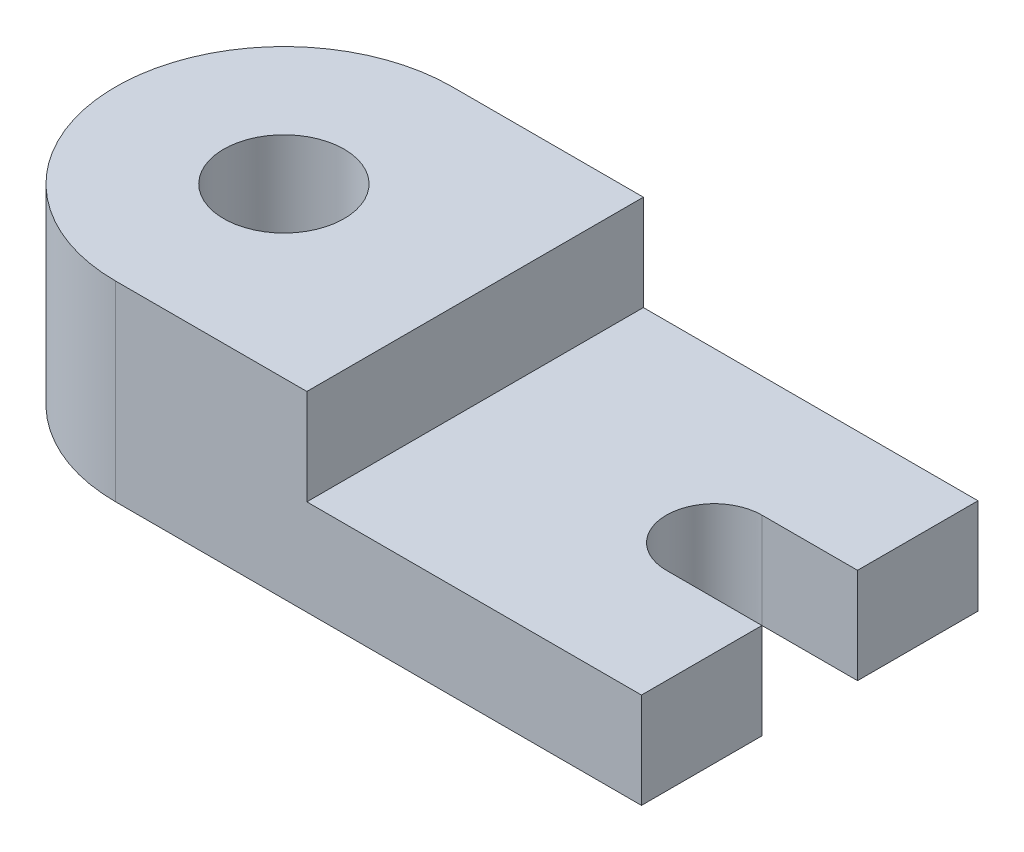
ISO-10303-21;
HEADER;
FILE_DESCRIPTION(('STEP AP214'),'2;1');
FILE_NAME('part.step','',(''),(''),'','','');
FILE_SCHEMA(('AUTOMOTIVE_DESIGN { 1 0 10303 214 1 1 1 1 }'));
ENDSEC;
DATA;
#1=APPLICATION_CONTEXT('core data for automotive mechanical design processes');
#2=APPLICATION_PROTOCOL_DEFINITION('international standard','automotive_design',2000,#1);
#3=PRODUCT_CONTEXT('',#1,'mechanical');
#4=PRODUCT('Part','Part','',(#3));
#5=PRODUCT_RELATED_PRODUCT_CATEGORY('part','',(#4));
#6=PRODUCT_DEFINITION_FORMATION('','',#4);
#7=PRODUCT_DEFINITION_CONTEXT('part definition',#1,'design');
#8=PRODUCT_DEFINITION('design','',#6,#7);
#9=PRODUCT_DEFINITION_SHAPE('','',#8);
#10=(LENGTH_UNIT() NAMED_UNIT(*) SI_UNIT(.MILLI.,.METRE.));
#11=(NAMED_UNIT(*) PLANE_ANGLE_UNIT() SI_UNIT($,.RADIAN.));
#12=(NAMED_UNIT(*) SI_UNIT($,.STERADIAN.) SOLID_ANGLE_UNIT());
#13=UNCERTAINTY_MEASURE_WITH_UNIT(LENGTH_MEASURE(1.E-05),#10,'distance_accuracy_value','');
#14=(GEOMETRIC_REPRESENTATION_CONTEXT(3) GLOBAL_UNCERTAINTY_ASSIGNED_CONTEXT((#13)) GLOBAL_UNIT_ASSIGNED_CONTEXT((#10,
#11,#12)) REPRESENTATION_CONTEXT('',''));
#15=CARTESIAN_POINT('',(0.,0.,0.));
#16=DIRECTION('',(0.,0.,1.));
#17=DIRECTION('',(1.,0.,0.));
#18=AXIS2_PLACEMENT_3D('',#15,#16,#17);
#19=CARTESIAN_POINT('',(0.,31.75,-22.352));
#20=DIRECTION('',(0.,0.,-1.));
#21=DIRECTION('',(-1.,0.,0.));
#22=AXIS2_PLACEMENT_3D('',#19,#20,#21);
#23=PLANE('',#22);
#24=DIRECTION('',(-1.,0.,0.));
#25=VECTOR('',#24,1.);
#26=CARTESIAN_POINT('',(25.4,25.4,-22.352));
#27=LINE('',#26,#25);
#28=CARTESIAN_POINT('',(25.4,25.4,-22.352));
#29=VERTEX_POINT('',#28);
#30=CARTESIAN_POINT('',(0.,25.4,-22.352));
#31=VERTEX_POINT('',#30);
#32=EDGE_CURVE('E120',#29,#31,#27,.T.);
#33=ORIENTED_EDGE('',*,*,#32,.F.);
#34=DIRECTION('',(0.,-1.,0.));
#35=VECTOR('',#34,1.);
#36=CARTESIAN_POINT('',(25.4,31.75,-22.352));
#37=LINE('',#36,#35);
#38=CARTESIAN_POINT('',(25.4,12.7,-22.352));
#39=VERTEX_POINT('',#38);
#40=EDGE_CURVE('E65',#29,#39,#37,.T.);
#41=ORIENTED_EDGE('',*,*,#40,.T.);
#42=DIRECTION('',(1.,0.,0.));
#43=VECTOR('',#42,1.);
#44=CARTESIAN_POINT('',(0.,12.7,-22.352));
#45=LINE('',#44,#43);
#46=CARTESIAN_POINT('',(69.85,12.7,-22.352));
#47=VERTEX_POINT('',#46);
#48=EDGE_CURVE('E221',#39,#47,#45,.T.);
#49=ORIENTED_EDGE('',*,*,#48,.T.);
#50=DIRECTION('',(0.,-1.,0.));
#51=VECTOR('',#50,1.);
#52=CARTESIAN_POINT('',(69.85,12.7,-22.352));
#53=LINE('',#52,#51);
#54=CARTESIAN_POINT('',(69.85,0.,-22.352));
#55=VERTEX_POINT('',#54);
#56=EDGE_CURVE('E176',#47,#55,#53,.T.);
#57=ORIENTED_EDGE('',*,*,#56,.T.);
#58=DIRECTION('',(1.,0.,0.));
#59=VECTOR('',#58,1.);
#60=CARTESIAN_POINT('',(0.,0.,-22.352));
#61=LINE('',#60,#59);
#62=CARTESIAN_POINT('',(0.,0.,-22.352));
#63=VERTEX_POINT('',#62);
#64=EDGE_CURVE('E162',#63,#55,#61,.T.);
#65=ORIENTED_EDGE('',*,*,#64,.F.);
#66=DIRECTION('',(0.,-1.,0.));
#67=VECTOR('',#66,1.);
#68=CARTESIAN_POINT('',(0.,31.75,-22.352));
#69=LINE('',#68,#67);
#70=EDGE_CURVE('E11',#31,#63,#69,.T.);
#71=ORIENTED_EDGE('',*,*,#70,.F.);
#72=EDGE_LOOP('',(#33,#41,#49,#57,#65,#71));
#73=FACE_BOUND('',#72,.T.);
#74=ADVANCED_FACE('F41',(#73),#23,.T.);
#75=CARTESIAN_POINT('',(0.,31.75,0.));
#76=DIRECTION('',(0.,-1.,0.));
#77=DIRECTION('',(0.,0.,-1.));
#78=AXIS2_PLACEMENT_3D('',#75,#76,#77);
#79=CYLINDRICAL_SURFACE('',#78,22.352);
#80=DIRECTION('',(0.,-1.,0.));
#81=VECTOR('',#80,1.);
#82=CARTESIAN_POINT('',(0.,31.75,22.352));
#83=LINE('',#82,#81);
#84=CARTESIAN_POINT('',(0.,25.4,22.352));
#85=VERTEX_POINT('',#84);
#86=CARTESIAN_POINT('',(0.,0.,22.352));
#87=VERTEX_POINT('',#86);
#88=EDGE_CURVE('E50',#85,#87,#83,.T.);
#89=ORIENTED_EDGE('',*,*,#88,.F.);
#90=CARTESIAN_POINT('',(0.,25.4,0.));
#91=DIRECTION('',(0.,-1.,0.));
#92=DIRECTION('',(0.,0.,-1.));
#93=AXIS2_PLACEMENT_3D('',#90,#91,#92);
#94=CIRCLE('',#93,22.352);
#95=EDGE_CURVE('E209',#85,#31,#94,.T.);
#96=ORIENTED_EDGE('',*,*,#95,.T.);
#97=ORIENTED_EDGE('',*,*,#70,.T.);
#98=CARTESIAN_POINT('',(0.,0.,0.));
#99=DIRECTION('',(0.,1.,0.));
#100=DIRECTION('',(0.,0.,1.));
#101=AXIS2_PLACEMENT_3D('',#98,#99,#100);
#102=CIRCLE('',#101,22.352);
#103=EDGE_CURVE('E141',#63,#87,#102,.T.);
#104=ORIENTED_EDGE('',*,*,#103,.T.);
#105=EDGE_LOOP('',(#89,#96,#97,#104));
#106=FACE_BOUND('',#105,.T.);
#107=ADVANCED_FACE('F160',(#106),#79,.T.);
#108=CARTESIAN_POINT('',(0.,31.75,22.352));
#109=DIRECTION('',(0.,0.,-1.));
#110=DIRECTION('',(-1.,0.,0.));
#111=AXIS2_PLACEMENT_3D('',#108,#109,#110);
#112=PLANE('',#111);
#113=DIRECTION('',(0.,-1.,0.));
#114=VECTOR('',#113,1.);
#115=CARTESIAN_POINT('',(25.4,31.75,22.352));
#116=LINE('',#115,#114);
#117=CARTESIAN_POINT('',(25.4,25.4,22.352));
#118=VERTEX_POINT('',#117);
#119=CARTESIAN_POINT('',(25.4,12.7,22.352));
#120=VERTEX_POINT('',#119);
#121=EDGE_CURVE('E135',#118,#120,#116,.T.);
#122=ORIENTED_EDGE('',*,*,#121,.F.);
#123=DIRECTION('',(-1.,0.,0.));
#124=VECTOR('',#123,1.);
#125=CARTESIAN_POINT('',(25.4,25.4,22.352));
#126=LINE('',#125,#124);
#127=EDGE_CURVE('E57',#118,#85,#126,.T.);
#128=ORIENTED_EDGE('',*,*,#127,.T.);
#129=ORIENTED_EDGE('',*,*,#88,.T.);
#130=DIRECTION('',(1.,0.,0.));
#131=VECTOR('',#130,1.);
#132=CARTESIAN_POINT('',(0.,0.,22.352));
#133=LINE('',#132,#131);
#134=CARTESIAN_POINT('',(69.85,0.,22.352));
#135=VERTEX_POINT('',#134);
#136=EDGE_CURVE('E136',#87,#135,#133,.T.);
#137=ORIENTED_EDGE('',*,*,#136,.T.);
#138=DIRECTION('',(0.,-1.,0.));
#139=VECTOR('',#138,1.);
#140=CARTESIAN_POINT('',(69.85,12.7,22.352));
#141=LINE('',#140,#139);
#142=CARTESIAN_POINT('',(69.85,12.7,22.352));
#143=VERTEX_POINT('',#142);
#144=EDGE_CURVE('E180',#143,#135,#141,.T.);
#145=ORIENTED_EDGE('',*,*,#144,.F.);
#146=DIRECTION('',(1.,0.,0.));
#147=VECTOR('',#146,1.);
#148=CARTESIAN_POINT('',(0.,12.7,22.352));
#149=LINE('',#148,#147);
#150=EDGE_CURVE('E216',#120,#143,#149,.T.);
#151=ORIENTED_EDGE('',*,*,#150,.F.);
#152=EDGE_LOOP('',(#122,#128,#129,#137,#145,#151));
#153=FACE_BOUND('',#152,.T.);
#154=ADVANCED_FACE('F148',(#153),#112,.F.);
#155=CARTESIAN_POINT('',(0.,31.75,0.));
#156=DIRECTION('',(0.,-1.,0.));
#157=DIRECTION('',(0.,0.,-1.));
#158=AXIS2_PLACEMENT_3D('',#155,#156,#157);
#159=CYLINDRICAL_SURFACE('',#158,8.001);
#160=CARTESIAN_POINT('',(0.,25.4,0.));
#161=DIRECTION('',(0.,-1.,0.));
#162=DIRECTION('',(0.,0.,-1.));
#163=AXIS2_PLACEMENT_3D('',#160,#161,#162);
#164=CIRCLE('',#163,8.001);
#165=CARTESIAN_POINT('',(0.,25.4,-8.001));
#166=VERTEX_POINT('',#165);
#167=EDGE_CURVE('E128',#166,#166,#164,.T.);
#168=ORIENTED_EDGE('',*,*,#167,.F.);
#169=EDGE_LOOP('',(#168));
#170=FACE_BOUND('',#169,.T.);
#171=CARTESIAN_POINT('',(0.,0.,0.));
#172=DIRECTION('',(0.,1.,0.));
#173=DIRECTION('',(0.,0.,1.));
#174=AXIS2_PLACEMENT_3D('',#171,#172,#173);
#175=CIRCLE('',#174,8.001);
#176=CARTESIAN_POINT('',(0.,0.,8.001));
#177=VERTEX_POINT('',#176);
#178=EDGE_CURVE('E164',#177,#177,#175,.T.);
#179=ORIENTED_EDGE('',*,*,#178,.F.);
#180=EDGE_LOOP('',(#179));
#181=FACE_BOUND('',#180,.T.);
#182=ADVANCED_FACE('F43',(#170,#181),#159,.F.);
#183=CARTESIAN_POINT('',(25.4,31.75,0.));
#184=DIRECTION('',(1.,0.,0.));
#185=DIRECTION('',(0.,0.,-1.));
#186=AXIS2_PLACEMENT_3D('',#183,#184,#185);
#187=PLANE('',#186);
#188=DIRECTION('',(0.,0.,1.));
#189=VECTOR('',#188,1.);
#190=CARTESIAN_POINT('',(25.4,25.4,-22.352));
#191=LINE('',#190,#189);
#192=EDGE_CURVE('E118',#29,#118,#191,.T.);
#193=ORIENTED_EDGE('',*,*,#192,.T.);
#194=ORIENTED_EDGE('',*,*,#121,.T.);
#195=DIRECTION('',(0.,0.,1.));
#196=VECTOR('',#195,1.);
#197=CARTESIAN_POINT('',(25.4,12.7,0.));
#198=LINE('',#197,#196);
#199=EDGE_CURVE('E132',#39,#120,#198,.T.);
#200=ORIENTED_EDGE('',*,*,#199,.F.);
#201=ORIENTED_EDGE('',*,*,#40,.F.);
#202=EDGE_LOOP('',(#193,#194,#200,#201));
#203=FACE_BOUND('',#202,.T.);
#204=ADVANCED_FACE('F130',(#203),#187,.T.);
#205=CARTESIAN_POINT('',(0.,0.,0.));
#206=DIRECTION('',(0.,1.,0.));
#207=DIRECTION('',(0.,0.,1.));
#208=AXIS2_PLACEMENT_3D('',#205,#206,#207);
#209=PLANE('',#208);
#210=ORIENTED_EDGE('',*,*,#178,.T.);
#211=EDGE_LOOP('',(#210));
#212=FACE_BOUND('',#211,.T.);
#213=ORIENTED_EDGE('',*,*,#64,.T.);
#214=DIRECTION('',(0.,0.,1.));
#215=VECTOR('',#214,1.);
#216=CARTESIAN_POINT('',(69.85,0.,0.));
#217=LINE('',#216,#215);
#218=CARTESIAN_POINT('',(69.85,0.,-6.35000000000001));
#219=VERTEX_POINT('',#218);
#220=EDGE_CURVE('E197',#55,#219,#217,.T.);
#221=ORIENTED_EDGE('',*,*,#220,.T.);
#222=DIRECTION('',(-1.,0.,0.));
#223=VECTOR('',#222,1.);
#224=CARTESIAN_POINT('',(0.,0.,-6.35));
#225=LINE('',#224,#223);
#226=CARTESIAN_POINT('',(57.15,0.,-6.35000000000001));
#227=VERTEX_POINT('',#226);
#228=EDGE_CURVE('E201',#219,#227,#225,.T.);
#229=ORIENTED_EDGE('',*,*,#228,.T.);
#230=CARTESIAN_POINT('',(57.15,0.,0.));
#231=DIRECTION('',(0.,1.,0.));
#232=DIRECTION('',(0.,0.,1.));
#233=AXIS2_PLACEMENT_3D('',#230,#231,#232);
#234=CIRCLE('',#233,6.35);
#235=CARTESIAN_POINT('',(57.15,0.,6.34999999999999));
#236=VERTEX_POINT('',#235);
#237=EDGE_CURVE('E205',#227,#236,#234,.T.);
#238=ORIENTED_EDGE('',*,*,#237,.T.);
#239=DIRECTION('',(-1.,0.,0.));
#240=VECTOR('',#239,1.);
#241=CARTESIAN_POINT('',(0.,0.,6.35));
#242=LINE('',#241,#240);
#243=CARTESIAN_POINT('',(69.85,0.,6.34999999999999));
#244=VERTEX_POINT('',#243);
#245=EDGE_CURVE('E190',#244,#236,#242,.T.);
#246=ORIENTED_EDGE('',*,*,#245,.F.);
#247=DIRECTION('',(0.,0.,1.));
#248=VECTOR('',#247,1.);
#249=CARTESIAN_POINT('',(69.85,0.,0.));
#250=LINE('',#249,#248);
#251=EDGE_CURVE('E159',#244,#135,#250,.T.);
#252=ORIENTED_EDGE('',*,*,#251,.T.);
#253=ORIENTED_EDGE('',*,*,#136,.F.);
#254=ORIENTED_EDGE('',*,*,#103,.F.);
#255=EDGE_LOOP('',(#213,#221,#229,#238,#246,#252,#253,#254));
#256=FACE_BOUND('',#255,.T.);
#257=ADVANCED_FACE('F156',(#212,#256),#209,.F.);
#258=CARTESIAN_POINT('',(57.15,12.7,0.));
#259=DIRECTION('',(0.,-1.,0.));
#260=DIRECTION('',(0.,0.,-1.));
#261=AXIS2_PLACEMENT_3D('',#258,#259,#260);
#262=CYLINDRICAL_SURFACE('',#261,6.35);
#263=ORIENTED_EDGE('',*,*,#237,.F.);
#264=DIRECTION('',(0.,-1.,0.));
#265=VECTOR('',#264,1.);
#266=CARTESIAN_POINT('',(57.15,12.7,-6.35000000000001));
#267=LINE('',#266,#265);
#268=CARTESIAN_POINT('',(57.15,12.7,-6.35000000000001));
#269=VERTEX_POINT('',#268);
#270=EDGE_CURVE('E170',#269,#227,#267,.T.);
#271=ORIENTED_EDGE('',*,*,#270,.F.);
#272=CARTESIAN_POINT('',(57.15,12.7,0.));
#273=DIRECTION('',(0.,1.,0.));
#274=DIRECTION('',(0.,0.,1.));
#275=AXIS2_PLACEMENT_3D('',#272,#273,#274);
#276=CIRCLE('',#275,6.35);
#277=CARTESIAN_POINT('',(57.15,12.7,6.34999999999999));
#278=VERTEX_POINT('',#277);
#279=EDGE_CURVE('E194',#269,#278,#276,.T.);
#280=ORIENTED_EDGE('',*,*,#279,.T.);
#281=DIRECTION('',(0.,-1.,0.));
#282=VECTOR('',#281,1.);
#283=CARTESIAN_POINT('',(57.15,12.7,6.34999999999999));
#284=LINE('',#283,#282);
#285=EDGE_CURVE('E186',#278,#236,#284,.T.);
#286=ORIENTED_EDGE('',*,*,#285,.T.);
#287=EDGE_LOOP('',(#263,#271,#280,#286));
#288=FACE_BOUND('',#287,.T.);
#289=ADVANCED_FACE('F249',(#288),#262,.F.);
#290=CARTESIAN_POINT('',(0.,12.7,-6.35));
#291=DIRECTION('',(0.,0.,1.));
#292=DIRECTION('',(1.,0.,0.));
#293=AXIS2_PLACEMENT_3D('',#290,#291,#292);
#294=PLANE('',#293);
#295=ORIENTED_EDGE('',*,*,#228,.F.);
#296=DIRECTION('',(0.,-1.,0.));
#297=VECTOR('',#296,1.);
#298=CARTESIAN_POINT('',(69.85,12.7,-6.35000000000001));
#299=LINE('',#298,#297);
#300=CARTESIAN_POINT('',(69.85,12.7,-6.35000000000001));
#301=VERTEX_POINT('',#300);
#302=EDGE_CURVE('E173',#301,#219,#299,.T.);
#303=ORIENTED_EDGE('',*,*,#302,.F.);
#304=DIRECTION('',(-1.,0.,0.));
#305=VECTOR('',#304,1.);
#306=CARTESIAN_POINT('',(0.,12.7,-6.35));
#307=LINE('',#306,#305);
#308=EDGE_CURVE('E228',#301,#269,#307,.T.);
#309=ORIENTED_EDGE('',*,*,#308,.T.);
#310=ORIENTED_EDGE('',*,*,#270,.T.);
#311=EDGE_LOOP('',(#295,#303,#309,#310));
#312=FACE_BOUND('',#311,.T.);
#313=ADVANCED_FACE('F255',(#312),#294,.T.);
#314=CARTESIAN_POINT('',(69.85,12.7,0.));
#315=DIRECTION('',(1.,0.,0.));
#316=DIRECTION('',(0.,0.,-1.));
#317=AXIS2_PLACEMENT_3D('',#314,#315,#316);
#318=PLANE('',#317);
#319=ORIENTED_EDGE('',*,*,#220,.F.);
#320=ORIENTED_EDGE('',*,*,#56,.F.);
#321=DIRECTION('',(0.,0.,1.));
#322=VECTOR('',#321,1.);
#323=CARTESIAN_POINT('',(69.85,12.7,0.));
#324=LINE('',#323,#322);
#325=EDGE_CURVE('E224',#47,#301,#324,.T.);
#326=ORIENTED_EDGE('',*,*,#325,.T.);
#327=ORIENTED_EDGE('',*,*,#302,.T.);
#328=EDGE_LOOP('',(#319,#320,#326,#327));
#329=FACE_BOUND('',#328,.T.);
#330=ADVANCED_FACE('F312',(#329),#318,.T.);
#331=CARTESIAN_POINT('',(69.85,12.7,0.));
#332=DIRECTION('',(1.,0.,0.));
#333=DIRECTION('',(0.,0.,-1.));
#334=AXIS2_PLACEMENT_3D('',#331,#332,#333);
#335=PLANE('',#334);
#336=ORIENTED_EDGE('',*,*,#251,.F.);
#337=DIRECTION('',(0.,-1.,0.));
#338=VECTOR('',#337,1.);
#339=CARTESIAN_POINT('',(69.85,12.7,6.34999999999999));
#340=LINE('',#339,#338);
#341=CARTESIAN_POINT('',(69.85,12.7,6.34999999999999));
#342=VERTEX_POINT('',#341);
#343=EDGE_CURVE('E183',#342,#244,#340,.T.);
#344=ORIENTED_EDGE('',*,*,#343,.F.);
#345=DIRECTION('',(0.,0.,1.));
#346=VECTOR('',#345,1.);
#347=CARTESIAN_POINT('',(69.85,12.7,0.));
#348=LINE('',#347,#346);
#349=EDGE_CURVE('E212',#342,#143,#348,.T.);
#350=ORIENTED_EDGE('',*,*,#349,.T.);
#351=ORIENTED_EDGE('',*,*,#144,.T.);
#352=EDGE_LOOP('',(#336,#344,#350,#351));
#353=FACE_BOUND('',#352,.T.);
#354=ADVANCED_FACE('F304',(#353),#335,.T.);
#355=CARTESIAN_POINT('',(0.,12.7,6.35));
#356=DIRECTION('',(0.,0.,1.));
#357=DIRECTION('',(1.,0.,0.));
#358=AXIS2_PLACEMENT_3D('',#355,#356,#357);
#359=PLANE('',#358);
#360=ORIENTED_EDGE('',*,*,#245,.T.);
#361=ORIENTED_EDGE('',*,*,#285,.F.);
#362=DIRECTION('',(-1.,0.,0.));
#363=VECTOR('',#362,1.);
#364=CARTESIAN_POINT('',(0.,12.7,6.35));
#365=LINE('',#364,#363);
#366=EDGE_CURVE('E189',#342,#278,#365,.T.);
#367=ORIENTED_EDGE('',*,*,#366,.F.);
#368=ORIENTED_EDGE('',*,*,#343,.T.);
#369=EDGE_LOOP('',(#360,#361,#367,#368));
#370=FACE_BOUND('',#369,.T.);
#371=ADVANCED_FACE('F297',(#370),#359,.F.);
#372=CARTESIAN_POINT('',(0.,12.7,0.));
#373=DIRECTION('',(0.,1.,0.));
#374=DIRECTION('',(0.,0.,1.));
#375=AXIS2_PLACEMENT_3D('',#372,#373,#374);
#376=PLANE('',#375);
#377=ORIENTED_EDGE('',*,*,#279,.F.);
#378=ORIENTED_EDGE('',*,*,#308,.F.);
#379=ORIENTED_EDGE('',*,*,#325,.F.);
#380=ORIENTED_EDGE('',*,*,#48,.F.);
#381=ORIENTED_EDGE('',*,*,#199,.T.);
#382=ORIENTED_EDGE('',*,*,#150,.T.);
#383=ORIENTED_EDGE('',*,*,#349,.F.);
#384=ORIENTED_EDGE('',*,*,#366,.T.);
#385=EDGE_LOOP('',(#377,#378,#379,#380,#381,#382,#383,#384));
#386=FACE_BOUND('',#385,.T.);
#387=ADVANCED_FACE('F287',(#386),#376,.T.);
#388=CARTESIAN_POINT('',(0.,25.4,0.));
#389=DIRECTION('',(0.,-1.,0.));
#390=DIRECTION('',(0.,0.,-1.));
#391=AXIS2_PLACEMENT_3D('',#388,#389,#390);
#392=PLANE('',#391);
#393=ORIENTED_EDGE('',*,*,#167,.T.);
#394=EDGE_LOOP('',(#393));
#395=FACE_BOUND('',#394,.T.);
#396=ORIENTED_EDGE('',*,*,#127,.F.);
#397=ORIENTED_EDGE('',*,*,#192,.F.);
#398=ORIENTED_EDGE('',*,*,#32,.T.);
#399=ORIENTED_EDGE('',*,*,#95,.F.);
#400=EDGE_LOOP('',(#396,#397,#398,#399));
#401=FACE_BOUND('',#400,.T.);
#402=ADVANCED_FACE('F119',(#395,#401),#392,.F.);
#403=CLOSED_SHELL('',(#74,#107,#154,#182,#204,#257,#289,#313,#330,#354,#371,#387,#402));
#404=MANIFOLD_SOLID_BREP('B2',#403);
#405=ADVANCED_BREP_SHAPE_REPRESENTATION('',(#18,#404),#14);
#406=SHAPE_DEFINITION_REPRESENTATION(#9,#405);
ENDSEC;
END-ISO-10303-21;
